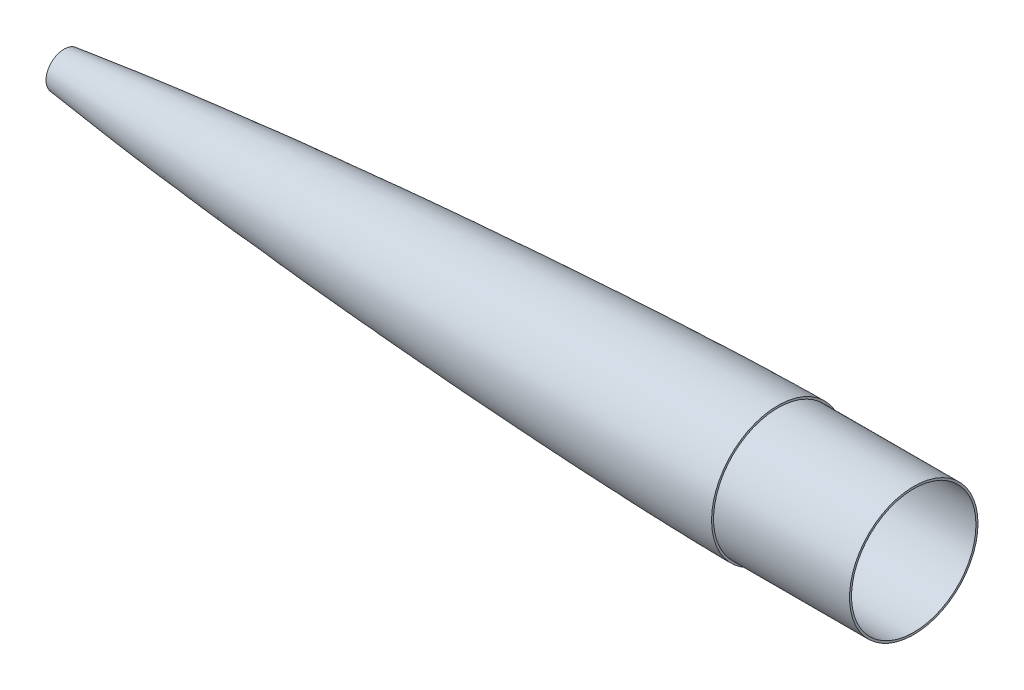
ISO-10303-21;
HEADER;
FILE_DESCRIPTION(('STEP AP214'),'2;1');
FILE_NAME('part.step','',(''),(''),'','','');
FILE_SCHEMA(('AUTOMOTIVE_DESIGN { 1 0 10303 214 1 1 1 1 }'));
ENDSEC;
DATA;
#1=APPLICATION_CONTEXT('core data for automotive mechanical design processes');
#2=APPLICATION_PROTOCOL_DEFINITION('international standard','automotive_design',2000,#1);
#3=PRODUCT_CONTEXT('',#1,'mechanical');
#4=PRODUCT('Part','Part','',(#3));
#5=PRODUCT_RELATED_PRODUCT_CATEGORY('part','',(#4));
#6=PRODUCT_DEFINITION_FORMATION('','',#4);
#7=PRODUCT_DEFINITION_CONTEXT('part definition',#1,'design');
#8=PRODUCT_DEFINITION('design','',#6,#7);
#9=PRODUCT_DEFINITION_SHAPE('','',#8);
#10=(LENGTH_UNIT() NAMED_UNIT(*) SI_UNIT(.MILLI.,.METRE.));
#11=(NAMED_UNIT(*) PLANE_ANGLE_UNIT() SI_UNIT($,.RADIAN.));
#12=(NAMED_UNIT(*) SI_UNIT($,.STERADIAN.) SOLID_ANGLE_UNIT());
#13=UNCERTAINTY_MEASURE_WITH_UNIT(LENGTH_MEASURE(1.E-05),#10,'distance_accuracy_value','');
#14=(GEOMETRIC_REPRESENTATION_CONTEXT(3) GLOBAL_UNCERTAINTY_ASSIGNED_CONTEXT((#13)) GLOBAL_UNIT_ASSIGNED_CONTEXT((#10,
#11,#12)) REPRESENTATION_CONTEXT('',''));
#15=CARTESIAN_POINT('',(0.,0.,0.));
#16=DIRECTION('',(0.,0.,1.));
#17=DIRECTION('',(1.,0.,0.));
#18=AXIS2_PLACEMENT_3D('',#15,#16,#17);
#19=CARTESIAN_POINT('',(1.0385097876542,-1.1153803929362,0.));
#20=CARTESIAN_POINT('',(1.09893605298462,-1.08297894284499,0.));
#21=CARTESIAN_POINT('',(1.2127924372323,-1.02787030130458,0.));
#22=CARTESIAN_POINT('',(1.52320515119354,-0.892151371118376,0.));
#23=CARTESIAN_POINT('',(2.10547232357311,-0.667737792910378,0.));
#24=CARTESIAN_POINT('',(2.95617233498537,-0.382449201299575,0.));
#25=CARTESIAN_POINT('',(3.82743659977351,-0.118803856979545,0.));
#26=CARTESIAN_POINT('',(4.57389962983086,0.0949411819436202,0.));
#27=CARTESIAN_POINT('',(5.75370345847201,0.419292958074721,0.));
#28=CARTESIAN_POINT('',(7.51864405141921,0.867813576452232,0.));
#29=CARTESIAN_POINT('',(10.59208304073,1.58768207948724,0.));
#30=CARTESIAN_POINT('',(14.4643255819888,2.4134338779529,0.));
#31=CARTESIAN_POINT('',(19.1367412255718,3.33006810019367,0.));
#32=CARTESIAN_POINT('',(23.8239350087144,4.19164010882075,0.));
#33=CARTESIAN_POINT('',(30.0890485638839,5.28296820090521,0.));
#34=CARTESIAN_POINT('',(37.9399485723849,6.56290567530488,0.));
#35=CARTESIAN_POINT('',(47.380982475131,7.99916424745217,0.));
#36=CARTESIAN_POINT('',(59.9884254649626,9.81234917432776,0.));
#37=CARTESIAN_POINT('',(75.7733994259209,11.9236727349697,0.));
#38=CARTESIAN_POINT('',(94.7431065320927,14.2754875413014,0.));
#39=CARTESIAN_POINT('',(113.732070410608,16.4843994364391,0.));
#40=CARTESIAN_POINT('',(132.736266707539,18.5734950423229,0.));
#41=CARTESIAN_POINT('',(158.091363841524,21.2217945029992,0.));
#42=CARTESIAN_POINT('',(189.810271800211,24.3061922379205,0.));
#43=CARTESIAN_POINT('',(227.902611514623,27.7085493166322,0.));
#44=CARTESIAN_POINT('',(266.018568132324,30.8488273212301,0.));
#45=CARTESIAN_POINT('',(304.154176987882,33.7495737078844,0.));
#46=CARTESIAN_POINT('',(342.30668076705,36.4241632659566,0.));
#47=CARTESIAN_POINT('',(393.196574129,39.6956854244625,0.));
#48=CARTESIAN_POINT('',(438.931967907022,42.2396382395747,0.));
#49=CARTESIAN_POINT('',(478.317604937928,44.1041804359616,0.));
#50=CARTESIAN_POINT('',(503.789466008046,45.2140056375641,0.));
#51=CARTESIAN_POINT('',(534.451677837959,46.3895550685888,0.));
#52=CARTESIAN_POINT('',(565.117800072625,47.3188281057994,0.));
#53=CARTESIAN_POINT('',(590.605905238724,47.8413129676625,0.));
#54=CARTESIAN_POINT('',(603.336130237284,48.0185065020114,0.));
#55=CARTESIAN_POINT('',(609.70348535128,48.0185065020114,0.));
#56=B_SPLINE_CURVE_WITH_KNOTS('',3,(#19,#20,#21,#22,#23,#24,#25,#26,#27,#28,#29,#30,#31,#32,#33,
#34,#35,#36,#37,#38,#39,#40,#41,#42,#43,#44,#45,#46,#47,#48,#49,#50,#51,#52,#53,#54,#55),
.UNSPECIFIED.,.F.,.F.,(4,1,1,1,1,1,1,1,1,1,1,1,1,1,1,1,1,1,1,1,1,1,1,1,1,1,1,1,1,1,1,1,1,1,4),
(0.000644865245185965,0.00113283161957796,0.00162079799396996,0.00259673074275396,
0.00454859624032196,0.00623409722561899,0.00721002997440299,0.00845232723545795,
0.0123560582305939,0.0162597892257299,0.0240672512160019,0.0318747132062739,0.0396821751965459,
0.0474896371868179,0.0631045611673619,0.0787194851479058,0.0943344091284498,0.125564257089538,
0.156794105050626,0.188023953011714,0.219253800972802,0.250483648933889,0.312943344856065,
0.375403040778241,0.437862736700417,0.500322432622593,0.562782128544769,0.625241824466945,
0.750161216311297,0.78719676794416,0.818426615905248,0.875080608155648,0.937540304077824,
0.968770152038912,1.),.UNSPECIFIED.);
#57=CARTESIAN_POINT('',(0.,0.,0.));
#58=DIRECTION('',(-1.,0.,0.));
#59=AXIS1_PLACEMENT('',#57,#58);
#60=SURFACE_OF_REVOLUTION('',#56,#59);
#61=CARTESIAN_POINT('',(76.2,0.,0.));
#62=DIRECTION('',(-1.,0.,0.));
#63=DIRECTION('',(0.,0.,1.));
#64=AXIS2_PLACEMENT_3D('',#61,#62,#63);
#65=CIRCLE('',#64,11.9477084924422);
#66=CARTESIAN_POINT('',(76.2,0.,11.9477084924422));
#67=VERTEX_POINT('',#66);
#68=EDGE_CURVE('E53',#67,#67,#65,.T.);
#69=ORIENTED_EDGE('',*,*,#68,.T.);
#70=EDGE_LOOP('',(#69));
#71=FACE_BOUND('',#70,.T.);
#72=CARTESIAN_POINT('',(584.30348535128,0.,0.));
#73=DIRECTION('',(-1.,0.,0.));
#74=DIRECTION('',(0.,0.,1.));
#75=AXIS2_PLACEMENT_3D('',#72,#73,#74);
#76=CIRCLE('',#75,47.7050644059589);
#77=CARTESIAN_POINT('',(584.30348535128,0.,47.7050644059589));
#78=VERTEX_POINT('',#77);
#79=EDGE_CURVE('E10',#78,#78,#76,.T.);
#80=ORIENTED_EDGE('',*,*,#79,.F.);
#81=EDGE_LOOP('',(#80));
#82=FACE_BOUND('',#81,.T.);
#83=ADVANCED_FACE('F45',(#71,#82),#60,.T.);
#84=CARTESIAN_POINT('',(76.2,0.,0.));
#85=DIRECTION('',(1.,0.,0.));
#86=DIRECTION('',(0.,0.,-1.));
#87=AXIS2_PLACEMENT_3D('',#84,#85,#86);
#88=PLANE('',#87);
#89=ORIENTED_EDGE('',*,*,#68,.F.);
#90=EDGE_LOOP('',(#89));
#91=FACE_BOUND('',#90,.T.);
#92=CARTESIAN_POINT('',(76.2,0.,0.));
#93=DIRECTION('',(-1.,0.,0.));
#94=DIRECTION('',(0.,0.,1.));
#95=AXIS2_PLACEMENT_3D('',#92,#93,#94);
#96=CIRCLE('',#95,13.4842536327206);
#97=CARTESIAN_POINT('',(76.2,0.,13.4842536327206));
#98=VERTEX_POINT('',#97);
#99=EDGE_CURVE('E63',#98,#98,#96,.T.);
#100=ORIENTED_EDGE('',*,*,#99,.T.);
#101=EDGE_LOOP('',(#100));
#102=FACE_BOUND('',#101,.T.);
#103=ADVANCED_FACE('F47',(#91,#102),#88,.F.);
#104=CARTESIAN_POINT('',(609.70348535128,0.,0.));
#105=DIRECTION('',(1.,0.,0.));
#106=DIRECTION('',(0.,0.,-1.));
#107=AXIS2_PLACEMENT_3D('',#104,#105,#106);
#108=PLANE('',#107);
#109=CARTESIAN_POINT('',(609.70348535128,0.,0.));
#110=DIRECTION('',(1.,0.,0.));
#111=DIRECTION('',(0.,0.,-1.));
#112=AXIS2_PLACEMENT_3D('',#109,#110,#111);
#113=CIRCLE('',#112,48.0185065020114);
#114=CARTESIAN_POINT('',(609.70348535128,0.,-48.0185065020114));
#115=VERTEX_POINT('',#114);
#116=EDGE_CURVE('E69',#115,#115,#113,.T.);
#117=ORIENTED_EDGE('',*,*,#116,.F.);
#118=EDGE_LOOP('',(#117));
#119=FACE_BOUND('',#118,.T.);
#120=CARTESIAN_POINT('',(609.70348535128,0.,0.));
#121=DIRECTION('',(-1.,0.,0.));
#122=DIRECTION('',(0.,0.,1.));
#123=AXIS2_PLACEMENT_3D('',#120,#121,#122);
#124=CIRCLE('',#123,49.5425065020114);
#125=CARTESIAN_POINT('',(609.70348535128,0.,49.5425065020114));
#126=VERTEX_POINT('',#125);
#127=EDGE_CURVE('E58',#126,#126,#124,.T.);
#128=ORIENTED_EDGE('',*,*,#127,.F.);
#129=EDGE_LOOP('',(#128));
#130=FACE_BOUND('',#129,.T.);
#131=ADVANCED_FACE('F87',(#119,#130),#108,.T.);
#132=CARTESIAN_POINT('',(0.,0.,0.));
#133=CARTESIAN_POINT('',(0.00257181598876534,0.00563647892327808,0.));
#134=CARTESIAN_POINT('',(0.00865027721043773,0.016277868188067,0.));
#135=CARTESIAN_POINT('',(0.0248384801324466,0.0348685420562156,0.));
#136=CARTESIAN_POINT('',(0.0614384417672664,0.0677963456999341,0.));
#137=CARTESIAN_POINT('',(0.11568341966958,0.108106243141846,0.));
#138=CARTESIAN_POINT('',(0.188045787553973,0.154613181207027,0.));
#139=CARTESIAN_POINT('',(0.290833283887297,0.214020735768307,0.));
#140=CARTESIAN_POINT('',(0.414160492695409,0.278607766397476,0.));
#141=CARTESIAN_POINT('',(0.55877725402866,0.348299143733321,0.));
#142=CARTESIAN_POINT('',(0.724730868066843,0.422703949125703,0.));
#143=CARTESIAN_POINT('',(0.964147344984012,0.524034823726031,0.));
#144=CARTESIAN_POINT('',(1.33465355418264,0.669679439824667,0.));
#145=CARTESIAN_POINT('',(1.96929361417393,0.897871424823104,0.));
#146=CARTESIAN_POINT('',(3.10701235418423,1.26505033553077,0.));
#147=CARTESIAN_POINT('',(5.14211506959707,1.84723026384309,0.));
#148=CARTESIAN_POINT('',(8.92455603778403,2.79359231386745,0.));
#149=CARTESIAN_POINT('',(16.0542729377819,4.33351779649455,0.));
#150=CARTESIAN_POINT('',(28.7745076201062,6.68193864572946,0.));
#151=CARTESIAN_POINT('',(49.7554347112055,9.993969511993,0.));
#152=CARTESIAN_POINT('',(78.1202345562474,13.844366236506,0.));
#153=CARTESIAN_POINT('',(112.134667742365,17.9128091000318,0.));
#154=CARTESIAN_POINT('',(149.319983257708,21.9007652238848,0.));
#155=CARTESIAN_POINT('',(186.540620523021,25.5413654843358,0.));
#156=CARTESIAN_POINT('',(223.788346525204,28.8925827212558,0.));
#157=CARTESIAN_POINT('',(261.057875937366,31.9908904002058,0.));
#158=CARTESIAN_POINT('',(298.345861541793,34.8582676495802,0.));
#159=CARTESIAN_POINT('',(335.649901649591,37.5082181088045,0.));
#160=CARTESIAN_POINT('',(372.968338263528,39.9470386835439,0.));
#161=CARTESIAN_POINT('',(410.299941717992,42.17527884003,0.));
#162=CARTESIAN_POINT('',(447.643848849022,44.1871595027002,0.));
#163=CARTESIAN_POINT('',(484.999447818464,45.9695757743082,0.));
#164=CARTESIAN_POINT('',(517.695494353918,47.3071895888364,0.));
#165=CARTESIAN_POINT('',(545.727627469833,48.2681790997089,0.));
#166=CARTESIAN_POINT('',(568.326311807242,48.8964051457863,0.));
#167=CARTESIAN_POINT('',(583.534683101899,49.2340511122822,0.));
#168=CARTESIAN_POINT('',(596.024563936293,49.4397361119118,0.));
#169=CARTESIAN_POINT('',(603.84094835907,49.5198604542286,0.));
#170=CARTESIAN_POINT('',(607.749290512623,49.5425065020114,0.));
#171=CARTESIAN_POINT('',(609.70348535128,49.5425065020114,0.));
#172=B_SPLINE_CURVE_WITH_KNOTS('',4,(#132,#133,#134,#135,#136,#137,#138,#139,#140,#141,#142,
#143,#144,#145,#146,#147,#148,#149,#150,#151,#152,#153,#154,#155,#156,#157,#158,#159,#160,#161,
#162,#163,#164,#165,#166,#167,#168,#169,#170,#171),.UNSPECIFIED.,.F.,.F.,(5,1,1,1,1,1,1,1,1,1,1,
1,1,1,1,1,1,1,1,1,1,1,1,1,1,1,1,1,1,1,1,1,1,1,1,1,5),(0.,4.00959970283614E-05,
8.01919940567228E-05,0.000160383988113446,0.000320767976226891,0.000481151964340337,
0.000641535952453783,0.000935614848436856,0.00122969374441993,0.00152943900771313,
0.00182918427100634,0.00263340723966375,0.00382932312564767,0.00593329825828828,
0.0096355048169594,0.0164551902691907,0.0292891879306469,0.0535632002983768,0.0941033087021242,
0.155163744590855,0.216224183272472,0.277284623116365,0.338345063432345,0.399405503930121,
0.460465944472848,0.521526384986833,0.58258682542494,0.643647265749543,0.704707705922787,
0.765768146139735,0.826828586986675,0.887889027586075,0.918419247730054,0.948949467874033,
0.974474733937016,0.987237366968508,1.),.UNSPECIFIED.);
#173=CARTESIAN_POINT('',(0.,0.,0.));
#174=DIRECTION('',(-1.,0.,0.));
#175=AXIS1_PLACEMENT('',#173,#174);
#176=SURFACE_OF_REVOLUTION('',#172,#175);
#177=ORIENTED_EDGE('',*,*,#127,.T.);
#178=EDGE_LOOP('',(#177));
#179=FACE_BOUND('',#178,.T.);
#180=ORIENTED_EDGE('',*,*,#99,.F.);
#181=EDGE_LOOP('',(#180));
#182=FACE_BOUND('',#181,.T.);
#183=ADVANCED_FACE('F82',(#179,#182),#176,.F.);
#184=CARTESIAN_POINT('',(584.30348535128,0.,0.));
#185=DIRECTION('',(1.,0.,0.));
#186=DIRECTION('',(0.,0.,-1.));
#187=AXIS2_PLACEMENT_3D('',#184,#185,#186);
#188=PLANE('',#187);
#189=CARTESIAN_POINT('',(584.30348535128,0.,0.));
#190=DIRECTION('',(1.,0.,0.));
#191=DIRECTION('',(0.,0.,-1.));
#192=AXIS2_PLACEMENT_3D('',#189,#190,#191);
#193=CIRCLE('',#192,46.4945065020114);
#194=CARTESIAN_POINT('',(584.30348535128,0.,-46.4945065020114));
#195=VERTEX_POINT('',#194);
#196=EDGE_CURVE('E169',#195,#195,#193,.T.);
#197=ORIENTED_EDGE('',*,*,#196,.T.);
#198=EDGE_LOOP('',(#197));
#199=FACE_BOUND('',#198,.T.);
#200=ORIENTED_EDGE('',*,*,#79,.T.);
#201=EDGE_LOOP('',(#200));
#202=FACE_BOUND('',#201,.T.);
#203=ADVANCED_FACE('F86',(#199,#202),#188,.F.);
#204=CARTESIAN_POINT('',(584.30348535128,0.,0.));
#205=DIRECTION('',(1.,0.,0.));
#206=DIRECTION('',(0.,0.,-1.));
#207=AXIS2_PLACEMENT_3D('',#204,#205,#206);
#208=CYLINDRICAL_SURFACE('',#207,48.0185065020114);
#209=ORIENTED_EDGE('',*,*,#116,.T.);
#210=EDGE_LOOP('',(#209));
#211=FACE_BOUND('',#210,.T.);
#212=CARTESIAN_POINT('',(711.30348535128,0.,0.));
#213=DIRECTION('',(1.,0.,0.));
#214=DIRECTION('',(0.,0.,-1.));
#215=AXIS2_PLACEMENT_3D('',#212,#213,#214);
#216=CIRCLE('',#215,48.0185065020114);
#217=CARTESIAN_POINT('',(711.30348535128,0.,-48.0185065020114));
#218=VERTEX_POINT('',#217);
#219=EDGE_CURVE('E161',#218,#218,#216,.T.);
#220=ORIENTED_EDGE('',*,*,#219,.F.);
#221=EDGE_LOOP('',(#220));
#222=FACE_BOUND('',#221,.T.);
#223=ADVANCED_FACE('F89',(#211,#222),#208,.T.);
#224=CARTESIAN_POINT('',(584.30348535128,0.,0.));
#225=DIRECTION('',(1.,0.,0.));
#226=DIRECTION('',(0.,0.,-1.));
#227=AXIS2_PLACEMENT_3D('',#224,#225,#226);
#228=CYLINDRICAL_SURFACE('',#227,46.4945065020114);
#229=ORIENTED_EDGE('',*,*,#196,.F.);
#230=EDGE_LOOP('',(#229));
#231=FACE_BOUND('',#230,.T.);
#232=CARTESIAN_POINT('',(711.30348535128,0.,0.));
#233=DIRECTION('',(1.,0.,0.));
#234=DIRECTION('',(0.,0.,-1.));
#235=AXIS2_PLACEMENT_3D('',#232,#233,#234);
#236=CIRCLE('',#235,46.4945065020114);
#237=CARTESIAN_POINT('',(711.30348535128,0.,-46.4945065020114));
#238=VERTEX_POINT('',#237);
#239=EDGE_CURVE('E164',#238,#238,#236,.T.);
#240=ORIENTED_EDGE('',*,*,#239,.T.);
#241=EDGE_LOOP('',(#240));
#242=FACE_BOUND('',#241,.T.);
#243=ADVANCED_FACE('F136',(#231,#242),#228,.F.);
#244=CARTESIAN_POINT('',(711.30348535128,0.,0.));
#245=DIRECTION('',(1.,0.,0.));
#246=DIRECTION('',(0.,0.,-1.));
#247=AXIS2_PLACEMENT_3D('',#244,#245,#246);
#248=PLANE('',#247);
#249=ORIENTED_EDGE('',*,*,#219,.T.);
#250=EDGE_LOOP('',(#249));
#251=FACE_BOUND('',#250,.T.);
#252=ORIENTED_EDGE('',*,*,#239,.F.);
#253=EDGE_LOOP('',(#252));
#254=FACE_BOUND('',#253,.T.);
#255=ADVANCED_FACE('F145',(#251,#254),#248,.T.);
#256=CLOSED_SHELL('',(#83,#103,#131,#183,#203,#223,#243,#255));
#257=MANIFOLD_SOLID_BREP('B2',#256);
#258=ADVANCED_BREP_SHAPE_REPRESENTATION('',(#18,#257),#14);
#259=SHAPE_DEFINITION_REPRESENTATION(#9,#258);
ENDSEC;
END-ISO-10303-21;
